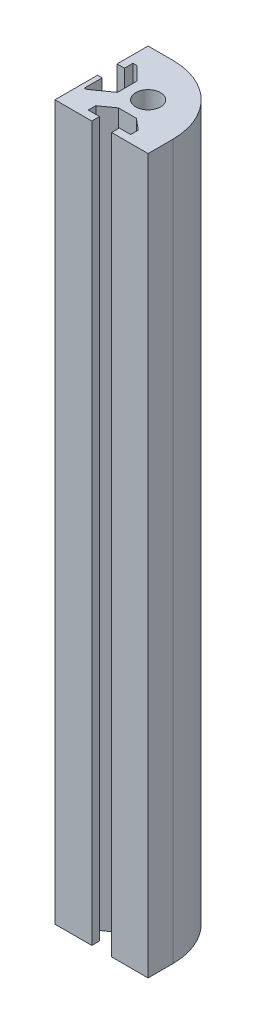
ISO-10303-21;
HEADER;
FILE_DESCRIPTION(('STEP AP214'),'2;1');
FILE_NAME('part.step','',(''),(''),'','','');
FILE_SCHEMA(('AUTOMOTIVE_DESIGN { 1 0 10303 214 1 1 1 1 }'));
ENDSEC;
DATA;
#1=APPLICATION_CONTEXT('core data for automotive mechanical design processes');
#2=APPLICATION_PROTOCOL_DEFINITION('international standard','automotive_design',2000,#1);
#3=PRODUCT_CONTEXT('',#1,'mechanical');
#4=PRODUCT('Part','Part','',(#3));
#5=PRODUCT_RELATED_PRODUCT_CATEGORY('part','',(#4));
#6=PRODUCT_DEFINITION_FORMATION('','',#4);
#7=PRODUCT_DEFINITION_CONTEXT('part definition',#1,'design');
#8=PRODUCT_DEFINITION('design','',#6,#7);
#9=PRODUCT_DEFINITION_SHAPE('','',#8);
#10=(LENGTH_UNIT() NAMED_UNIT(*) SI_UNIT(.MILLI.,.METRE.));
#11=(NAMED_UNIT(*) PLANE_ANGLE_UNIT() SI_UNIT($,.RADIAN.));
#12=(NAMED_UNIT(*) SI_UNIT($,.STERADIAN.) SOLID_ANGLE_UNIT());
#13=UNCERTAINTY_MEASURE_WITH_UNIT(LENGTH_MEASURE(1.E-05),#10,'distance_accuracy_value','');
#14=(GEOMETRIC_REPRESENTATION_CONTEXT(3) GLOBAL_UNCERTAINTY_ASSIGNED_CONTEXT((#13)) GLOBAL_UNIT_ASSIGNED_CONTEXT((#10,
#11,#12)) REPRESENTATION_CONTEXT('',''));
#15=CARTESIAN_POINT('',(0.,0.,0.));
#16=DIRECTION('',(0.,0.,1.));
#17=DIRECTION('',(1.,0.,0.));
#18=AXIS2_PLACEMENT_3D('',#15,#16,#17);
#19=CARTESIAN_POINT('',(-7.,230.,7.));
#20=DIRECTION('',(0.,-1.,0.));
#21=DIRECTION('',(0.,0.,-1.));
#22=AXIS2_PLACEMENT_3D('',#19,#20,#21);
#23=PLANE('',#22);
#24=DIRECTION('',(0.,0.,-1.));
#25=VECTOR('',#24,1.);
#26=CARTESIAN_POINT('',(15.,230.,15.));
#27=LINE('',#26,#25);
#28=CARTESIAN_POINT('',(15.,230.,15.));
#29=VERTEX_POINT('',#28);
#30=CARTESIAN_POINT('',(15.,230.,7.));
#31=VERTEX_POINT('',#30);
#32=EDGE_CURVE('E317',#29,#31,#27,.T.);
#33=ORIENTED_EDGE('',*,*,#32,.T.);
#34=CARTESIAN_POINT('',(-7.,230.,7.));
#35=DIRECTION('',(0.,1.,0.));
#36=DIRECTION('',(0.,0.,-1.));
#37=AXIS2_PLACEMENT_3D('',#34,#35,#36);
#38=CIRCLE('',#37,22.);
#39=CARTESIAN_POINT('',(-7.00000000000001,230.,-15.));
#40=VERTEX_POINT('',#39);
#41=EDGE_CURVE('E151',#31,#40,#38,.T.);
#42=ORIENTED_EDGE('',*,*,#41,.T.);
#43=DIRECTION('',(-1.,0.,0.));
#44=VECTOR('',#43,1.);
#45=CARTESIAN_POINT('',(-7.00000000000001,230.,-15.));
#46=LINE('',#45,#44);
#47=CARTESIAN_POINT('',(-15.,230.,-15.));
#48=VERTEX_POINT('',#47);
#49=EDGE_CURVE('E406',#40,#48,#46,.T.);
#50=ORIENTED_EDGE('',*,*,#49,.T.);
#51=DIRECTION('',(0.,0.,1.));
#52=VECTOR('',#51,1.);
#53=CARTESIAN_POINT('',(-15.,230.,-15.));
#54=LINE('',#53,#52);
#55=CARTESIAN_POINT('',(-15.,230.,-5.02760491674106));
#56=VERTEX_POINT('',#55);
#57=EDGE_CURVE('E426',#48,#56,#54,.T.);
#58=ORIENTED_EDGE('',*,*,#57,.T.);
#59=DIRECTION('',(1.,0.,0.));
#60=VECTOR('',#59,1.);
#61=CARTESIAN_POINT('',(-15.,230.,-5.02760491674106));
#62=LINE('',#61,#60);
#63=CARTESIAN_POINT('',(-12.62343706875,230.,-5.02760491674106));
#64=VERTEX_POINT('',#63);
#65=EDGE_CURVE('E422',#56,#64,#62,.T.);
#66=ORIENTED_EDGE('',*,*,#65,.T.);
#67=DIRECTION('',(0.,0.,-1.));
#68=VECTOR('',#67,1.);
#69=CARTESIAN_POINT('',(-12.62343706875,230.,-5.02760491674106));
#70=LINE('',#69,#68);
#71=CARTESIAN_POINT('',(-12.62343706875,230.,-7.75268234050665));
#72=VERTEX_POINT('',#71);
#73=EDGE_CURVE('E425',#64,#72,#70,.T.);
#74=ORIENTED_EDGE('',*,*,#73,.T.);
#75=DIRECTION('',(1.,0.,0.));
#76=VECTOR('',#75,1.);
#77=CARTESIAN_POINT('',(-12.62343706875,230.,-7.75268234050665));
#78=LINE('',#77,#76);
#79=CARTESIAN_POINT('',(-11.3205484379823,230.,-7.75268234050665));
#80=VERTEX_POINT('',#79);
#81=EDGE_CURVE('E430',#72,#80,#78,.T.);
#82=ORIENTED_EDGE('',*,*,#81,.T.);
#83=DIRECTION('',(0.707106781186548,0.,0.707106781186548));
#84=VECTOR('',#83,1.);
#85=CARTESIAN_POINT('',(-11.3205484379823,230.,-7.75268234050665));
#86=LINE('',#85,#84);
#87=CARTESIAN_POINT('',(-7.,230.,-3.43213390252437));
#88=VERTEX_POINT('',#87);
#89=EDGE_CURVE('E437',#80,#88,#86,.T.);
#90=ORIENTED_EDGE('',*,*,#89,.T.);
#91=DIRECTION('',(0.,0.,1.));
#92=VECTOR('',#91,1.);
#93=CARTESIAN_POINT('',(-7.,230.,-3.43213390252437));
#94=LINE('',#93,#92);
#95=CARTESIAN_POINT('',(-7.,230.,2.8610903108259));
#96=VERTEX_POINT('',#95);
#97=EDGE_CURVE('E440',#88,#96,#94,.T.);
#98=ORIENTED_EDGE('',*,*,#97,.T.);
#99=DIRECTION('',(-0.813663912579942,0.,0.581335563478702));
#100=VECTOR('',#99,1.);
#101=CARTESIAN_POINT('',(-7.,230.,2.8610903108259));
#102=LINE('',#101,#100);
#103=CARTESIAN_POINT('',(-12.793007796317,230.,7.00000000000001));
#104=VERTEX_POINT('',#103);
#105=EDGE_CURVE('E443',#96,#104,#102,.T.);
#106=ORIENTED_EDGE('',*,*,#105,.T.);
#107=DIRECTION('',(-1.,0.,0.));
#108=VECTOR('',#107,1.);
#109=CARTESIAN_POINT('',(-12.793007796317,230.,7.00000000000001));
#110=LINE('',#109,#108);
#111=CARTESIAN_POINT('',(-13.5272861174793,230.,7.00000000000001));
#112=VERTEX_POINT('',#111);
#113=EDGE_CURVE('E446',#104,#112,#110,.T.);
#114=ORIENTED_EDGE('',*,*,#113,.T.);
#115=DIRECTION('',(0.,0.,-1.));
#116=VECTOR('',#115,1.);
#117=CARTESIAN_POINT('',(-13.5272861174793,230.,7.00000000000001));
#118=LINE('',#117,#116);
#119=CARTESIAN_POINT('',(-13.5272861174793,230.,1.25796789040179));
#120=VERTEX_POINT('',#119);
#121=EDGE_CURVE('E449',#112,#120,#118,.T.);
#122=ORIENTED_EDGE('',*,*,#121,.T.);
#123=DIRECTION('',(-1.,0.,0.));
#124=VECTOR('',#123,1.);
#125=CARTESIAN_POINT('',(-13.5272861174793,230.,1.25796789040179));
#126=LINE('',#125,#124);
#127=CARTESIAN_POINT('',(-15.,230.,1.25796789040179));
#128=VERTEX_POINT('',#127);
#129=EDGE_CURVE('E452',#120,#128,#126,.T.);
#130=ORIENTED_EDGE('',*,*,#129,.T.);
#131=DIRECTION('',(0.,0.,1.));
#132=VECTOR('',#131,1.);
#133=CARTESIAN_POINT('',(-15.,230.,1.25796789040179));
#134=LINE('',#133,#132);
#135=CARTESIAN_POINT('',(-15.,230.,15.));
#136=VERTEX_POINT('',#135);
#137=EDGE_CURVE('E455',#128,#136,#134,.T.);
#138=ORIENTED_EDGE('',*,*,#137,.T.);
#139=DIRECTION('',(1.,0.,0.));
#140=VECTOR('',#139,1.);
#141=CARTESIAN_POINT('',(-15.,230.,15.));
#142=LINE('',#141,#140);
#143=CARTESIAN_POINT('',(-3.13994125446428,230.,15.));
#144=VERTEX_POINT('',#143);
#145=EDGE_CURVE('E458',#136,#144,#142,.T.);
#146=ORIENTED_EDGE('',*,*,#145,.T.);
#147=DIRECTION('',(0.,0.,-1.));
#148=VECTOR('',#147,1.);
#149=CARTESIAN_POINT('',(-3.13994125446428,230.,15.));
#150=LINE('',#149,#148);
#151=CARTESIAN_POINT('',(-3.13994125446428,230.,12.5058350189732));
#152=VERTEX_POINT('',#151);
#153=EDGE_CURVE('E461',#144,#152,#150,.T.);
#154=ORIENTED_EDGE('',*,*,#153,.T.);
#155=DIRECTION('',(-1.,0.,0.));
#156=VECTOR('',#155,1.);
#157=CARTESIAN_POINT('',(-3.13994125446428,230.,12.5058350189732));
#158=LINE('',#157,#156);
#159=CARTESIAN_POINT('',(-6.77895709017856,230.,12.5058350189732));
#160=VERTEX_POINT('',#159);
#161=EDGE_CURVE('E464',#152,#160,#158,.T.);
#162=ORIENTED_EDGE('',*,*,#161,.T.);
#163=DIRECTION('',(0.,0.,-1.));
#164=VECTOR('',#163,1.);
#165=CARTESIAN_POINT('',(-6.77895709017856,230.,12.5058350189732));
#166=LINE('',#165,#164);
#167=CARTESIAN_POINT('',(-6.77895709017856,230.,10.0798244618304));
#168=VERTEX_POINT('',#167);
#169=EDGE_CURVE('E467',#160,#168,#166,.T.);
#170=ORIENTED_EDGE('',*,*,#169,.T.);
#171=DIRECTION('',(0.813663912579942,0.,-0.581335563478702));
#172=VECTOR('',#171,1.);
#173=CARTESIAN_POINT('',(-6.77895709017856,230.,10.0798244618304));
#174=LINE('',#173,#172);
#175=CARTESIAN_POINT('',(-2.51290963769489,230.,7.03187670198325));
#176=VERTEX_POINT('',#175);
#177=EDGE_CURVE('E470',#168,#176,#174,.T.);
#178=ORIENTED_EDGE('',*,*,#177,.T.);
#179=DIRECTION('',(1.,0.,0.));
#180=VECTOR('',#179,1.);
#181=CARTESIAN_POINT('',(-2.51290963769489,230.,7.03187670198325));
#182=LINE('',#181,#180);
#183=CARTESIAN_POINT('',(3.25590475982143,230.,7.03187670198325));
#184=VERTEX_POINT('',#183);
#185=EDGE_CURVE('E473',#176,#184,#182,.T.);
#186=ORIENTED_EDGE('',*,*,#185,.T.);
#187=DIRECTION('',(0.766619760050027,0.,0.642101349866857));
#188=VECTOR('',#187,1.);
#189=CARTESIAN_POINT('',(3.25590475982143,230.,7.03187670198325));
#190=LINE('',#189,#188);
#191=CARTESIAN_POINT('',(6.89492059553572,230.,10.0798244618304));
#192=VERTEX_POINT('',#191);
#193=EDGE_CURVE('E476',#184,#192,#190,.T.);
#194=ORIENTED_EDGE('',*,*,#193,.T.);
#195=DIRECTION('',(0.,0.,1.));
#196=VECTOR('',#195,1.);
#197=CARTESIAN_POINT('',(6.89492059553572,230.,10.0798244618304));
#198=LINE('',#197,#196);
#199=CARTESIAN_POINT('',(6.89492059553572,230.,12.5058350189732));
#200=VERTEX_POINT('',#199);
#201=EDGE_CURVE('E221',#192,#200,#198,.T.);
#202=ORIENTED_EDGE('',*,*,#201,.T.);
#203=DIRECTION('',(-1.,0.,0.));
#204=VECTOR('',#203,1.);
#205=CARTESIAN_POINT('',(6.89492059553572,230.,12.5058350189732));
#206=LINE('',#205,#204);
#207=CARTESIAN_POINT('',(3.25590475982143,230.,12.5058350189732));
#208=VERTEX_POINT('',#207);
#209=EDGE_CURVE('E215',#200,#208,#206,.T.);
#210=ORIENTED_EDGE('',*,*,#209,.T.);
#211=DIRECTION('',(0.,0.,1.));
#212=VECTOR('',#211,1.);
#213=CARTESIAN_POINT('',(3.25590475982143,230.,12.5058350189732));
#214=LINE('',#213,#212);
#215=CARTESIAN_POINT('',(3.25590475982143,230.,15.));
#216=VERTEX_POINT('',#215);
#217=EDGE_CURVE('E219',#208,#216,#214,.T.);
#218=ORIENTED_EDGE('',*,*,#217,.T.);
#219=DIRECTION('',(1.,0.,0.));
#220=VECTOR('',#219,1.);
#221=CARTESIAN_POINT('',(3.25590475982143,230.,15.));
#222=LINE('',#221,#220);
#223=EDGE_CURVE('E57',#216,#29,#222,.T.);
#224=ORIENTED_EDGE('',*,*,#223,.T.);
#225=EDGE_LOOP('',(#33,#42,#50,#58,#66,#74,#82,#90,#98,#106,#114,#122,#130,#138,#146,#154,#162,
#170,#178,#186,#194,#202,#210,#218,#224));
#226=FACE_BOUND('',#225,.T.);
#227=CARTESIAN_POINT('',(0.,230.,0.));
#228=DIRECTION('',(0.,1.,0.));
#229=DIRECTION('',(0.,0.,1.));
#230=AXIS2_PLACEMENT_3D('',#227,#228,#229);
#231=CIRCLE('',#230,4.);
#232=CARTESIAN_POINT('',(0.,230.,4.));
#233=VERTEX_POINT('',#232);
#234=EDGE_CURVE('E248',#233,#233,#231,.T.);
#235=ORIENTED_EDGE('',*,*,#234,.F.);
#236=EDGE_LOOP('',(#235));
#237=FACE_BOUND('',#236,.T.);
#238=ADVANCED_FACE('F39',(#226,#237),#23,.F.);
#239=CARTESIAN_POINT('',(-7.,0.,7.));
#240=DIRECTION('',(0.,-1.,0.));
#241=DIRECTION('',(0.,0.,-1.));
#242=AXIS2_PLACEMENT_3D('',#239,#240,#241);
#243=PLANE('',#242);
#244=DIRECTION('',(0.,0.,-1.));
#245=VECTOR('',#244,1.);
#246=CARTESIAN_POINT('',(15.,0.,15.));
#247=LINE('',#246,#245);
#248=CARTESIAN_POINT('',(15.,0.,15.));
#249=VERTEX_POINT('',#248);
#250=CARTESIAN_POINT('',(15.,0.,7.));
#251=VERTEX_POINT('',#250);
#252=EDGE_CURVE('E243',#249,#251,#247,.T.);
#253=ORIENTED_EDGE('',*,*,#252,.F.);
#254=DIRECTION('',(1.,0.,0.));
#255=VECTOR('',#254,1.);
#256=CARTESIAN_POINT('',(3.25590475982143,0.,15.));
#257=LINE('',#256,#255);
#258=CARTESIAN_POINT('',(3.25590475982143,0.,15.));
#259=VERTEX_POINT('',#258);
#260=EDGE_CURVE('E143',#259,#249,#257,.T.);
#261=ORIENTED_EDGE('',*,*,#260,.F.);
#262=DIRECTION('',(0.,0.,1.));
#263=VECTOR('',#262,1.);
#264=CARTESIAN_POINT('',(3.25590475982143,0.,12.5058350189732));
#265=LINE('',#264,#263);
#266=CARTESIAN_POINT('',(3.25590475982143,0.,12.5058350189732));
#267=VERTEX_POINT('',#266);
#268=EDGE_CURVE('E137',#267,#259,#265,.T.);
#269=ORIENTED_EDGE('',*,*,#268,.F.);
#270=DIRECTION('',(-1.,0.,0.));
#271=VECTOR('',#270,1.);
#272=CARTESIAN_POINT('',(6.89492059553572,0.,12.5058350189732));
#273=LINE('',#272,#271);
#274=CARTESIAN_POINT('',(6.89492059553572,0.,12.5058350189732));
#275=VERTEX_POINT('',#274);
#276=EDGE_CURVE('E230',#275,#267,#273,.T.);
#277=ORIENTED_EDGE('',*,*,#276,.F.);
#278=DIRECTION('',(0.,0.,1.));
#279=VECTOR('',#278,1.);
#280=CARTESIAN_POINT('',(6.89492059553572,0.,10.0798244618304));
#281=LINE('',#280,#279);
#282=CARTESIAN_POINT('',(6.89492059553572,0.,10.0798244618304));
#283=VERTEX_POINT('',#282);
#284=EDGE_CURVE('E308',#283,#275,#281,.T.);
#285=ORIENTED_EDGE('',*,*,#284,.F.);
#286=DIRECTION('',(0.766619760050027,0.,0.642101349866857));
#287=VECTOR('',#286,1.);
#288=CARTESIAN_POINT('',(3.25590475982143,0.,7.03187670198325));
#289=LINE('',#288,#287);
#290=CARTESIAN_POINT('',(3.25590475982143,0.,7.03187670198325));
#291=VERTEX_POINT('',#290);
#292=EDGE_CURVE('E305',#291,#283,#289,.T.);
#293=ORIENTED_EDGE('',*,*,#292,.F.);
#294=DIRECTION('',(1.,0.,0.));
#295=VECTOR('',#294,1.);
#296=CARTESIAN_POINT('',(-2.51290963769489,0.,7.03187670198325));
#297=LINE('',#296,#295);
#298=CARTESIAN_POINT('',(-2.51290963769489,0.,7.03187670198325));
#299=VERTEX_POINT('',#298);
#300=EDGE_CURVE('E302',#299,#291,#297,.T.);
#301=ORIENTED_EDGE('',*,*,#300,.F.);
#302=DIRECTION('',(0.813663912579942,0.,-0.581335563478702));
#303=VECTOR('',#302,1.);
#304=CARTESIAN_POINT('',(-6.77895709017856,0.,10.0798244618304));
#305=LINE('',#304,#303);
#306=CARTESIAN_POINT('',(-6.77895709017856,0.,10.0798244618304));
#307=VERTEX_POINT('',#306);
#308=EDGE_CURVE('E299',#307,#299,#305,.T.);
#309=ORIENTED_EDGE('',*,*,#308,.F.);
#310=DIRECTION('',(0.,0.,-1.));
#311=VECTOR('',#310,1.);
#312=CARTESIAN_POINT('',(-6.77895709017856,0.,12.5058350189732));
#313=LINE('',#312,#311);
#314=CARTESIAN_POINT('',(-6.77895709017856,0.,12.5058350189732));
#315=VERTEX_POINT('',#314);
#316=EDGE_CURVE('E296',#315,#307,#313,.T.);
#317=ORIENTED_EDGE('',*,*,#316,.F.);
#318=DIRECTION('',(-1.,0.,0.));
#319=VECTOR('',#318,1.);
#320=CARTESIAN_POINT('',(-3.13994125446428,0.,12.5058350189732));
#321=LINE('',#320,#319);
#322=CARTESIAN_POINT('',(-3.13994125446428,0.,12.5058350189732));
#323=VERTEX_POINT('',#322);
#324=EDGE_CURVE('E293',#323,#315,#321,.T.);
#325=ORIENTED_EDGE('',*,*,#324,.F.);
#326=DIRECTION('',(0.,0.,-1.));
#327=VECTOR('',#326,1.);
#328=CARTESIAN_POINT('',(-3.13994125446428,0.,15.));
#329=LINE('',#328,#327);
#330=CARTESIAN_POINT('',(-3.13994125446428,0.,15.));
#331=VERTEX_POINT('',#330);
#332=EDGE_CURVE('E290',#331,#323,#329,.T.);
#333=ORIENTED_EDGE('',*,*,#332,.F.);
#334=DIRECTION('',(1.,0.,0.));
#335=VECTOR('',#334,1.);
#336=CARTESIAN_POINT('',(-15.,0.,15.));
#337=LINE('',#336,#335);
#338=CARTESIAN_POINT('',(-15.,0.,15.));
#339=VERTEX_POINT('',#338);
#340=EDGE_CURVE('E287',#339,#331,#337,.T.);
#341=ORIENTED_EDGE('',*,*,#340,.F.);
#342=DIRECTION('',(0.,0.,1.));
#343=VECTOR('',#342,1.);
#344=CARTESIAN_POINT('',(-15.,0.,1.25796789040179));
#345=LINE('',#344,#343);
#346=CARTESIAN_POINT('',(-15.,0.,1.25796789040179));
#347=VERTEX_POINT('',#346);
#348=EDGE_CURVE('E284',#347,#339,#345,.T.);
#349=ORIENTED_EDGE('',*,*,#348,.F.);
#350=DIRECTION('',(-1.,0.,0.));
#351=VECTOR('',#350,1.);
#352=CARTESIAN_POINT('',(-13.5272861174793,0.,1.25796789040179));
#353=LINE('',#352,#351);
#354=CARTESIAN_POINT('',(-13.5272861174793,0.,1.25796789040179));
#355=VERTEX_POINT('',#354);
#356=EDGE_CURVE('E281',#355,#347,#353,.T.);
#357=ORIENTED_EDGE('',*,*,#356,.F.);
#358=DIRECTION('',(0.,0.,-1.));
#359=VECTOR('',#358,1.);
#360=CARTESIAN_POINT('',(-13.5272861174793,0.,7.00000000000001));
#361=LINE('',#360,#359);
#362=CARTESIAN_POINT('',(-13.5272861174793,0.,7.00000000000001));
#363=VERTEX_POINT('',#362);
#364=EDGE_CURVE('E278',#363,#355,#361,.T.);
#365=ORIENTED_EDGE('',*,*,#364,.F.);
#366=DIRECTION('',(-1.,0.,0.));
#367=VECTOR('',#366,1.);
#368=CARTESIAN_POINT('',(-12.793007796317,0.,7.00000000000001));
#369=LINE('',#368,#367);
#370=CARTESIAN_POINT('',(-12.793007796317,0.,7.00000000000001));
#371=VERTEX_POINT('',#370);
#372=EDGE_CURVE('E275',#371,#363,#369,.T.);
#373=ORIENTED_EDGE('',*,*,#372,.F.);
#374=DIRECTION('',(-0.813663912579942,0.,0.581335563478702));
#375=VECTOR('',#374,1.);
#376=CARTESIAN_POINT('',(-7.,0.,2.8610903108259));
#377=LINE('',#376,#375);
#378=CARTESIAN_POINT('',(-7.,0.,2.8610903108259));
#379=VERTEX_POINT('',#378);
#380=EDGE_CURVE('E272',#379,#371,#377,.T.);
#381=ORIENTED_EDGE('',*,*,#380,.F.);
#382=DIRECTION('',(0.,0.,1.));
#383=VECTOR('',#382,1.);
#384=CARTESIAN_POINT('',(-7.,0.,-3.43213390252437));
#385=LINE('',#384,#383);
#386=CARTESIAN_POINT('',(-7.,0.,-3.43213390252437));
#387=VERTEX_POINT('',#386);
#388=EDGE_CURVE('E269',#387,#379,#385,.T.);
#389=ORIENTED_EDGE('',*,*,#388,.F.);
#390=DIRECTION('',(0.707106781186548,0.,0.707106781186548));
#391=VECTOR('',#390,1.);
#392=CARTESIAN_POINT('',(-11.3205484379823,0.,-7.75268234050665));
#393=LINE('',#392,#391);
#394=CARTESIAN_POINT('',(-11.3205484379823,0.,-7.75268234050665));
#395=VERTEX_POINT('',#394);
#396=EDGE_CURVE('E266',#395,#387,#393,.T.);
#397=ORIENTED_EDGE('',*,*,#396,.F.);
#398=DIRECTION('',(1.,0.,0.));
#399=VECTOR('',#398,1.);
#400=CARTESIAN_POINT('',(-12.62343706875,0.,-7.75268234050665));
#401=LINE('',#400,#399);
#402=CARTESIAN_POINT('',(-12.62343706875,0.,-7.75268234050665));
#403=VERTEX_POINT('',#402);
#404=EDGE_CURVE('E263',#403,#395,#401,.T.);
#405=ORIENTED_EDGE('',*,*,#404,.F.);
#406=DIRECTION('',(0.,0.,-1.));
#407=VECTOR('',#406,1.);
#408=CARTESIAN_POINT('',(-12.62343706875,0.,-5.02760491674106));
#409=LINE('',#408,#407);
#410=CARTESIAN_POINT('',(-12.62343706875,0.,-5.02760491674106));
#411=VERTEX_POINT('',#410);
#412=EDGE_CURVE('E260',#411,#403,#409,.T.);
#413=ORIENTED_EDGE('',*,*,#412,.F.);
#414=DIRECTION('',(1.,0.,0.));
#415=VECTOR('',#414,1.);
#416=CARTESIAN_POINT('',(-15.,0.,-5.02760491674106));
#417=LINE('',#416,#415);
#418=CARTESIAN_POINT('',(-15.,0.,-5.02760491674106));
#419=VERTEX_POINT('',#418);
#420=EDGE_CURVE('E257',#419,#411,#417,.T.);
#421=ORIENTED_EDGE('',*,*,#420,.F.);
#422=DIRECTION('',(0.,0.,1.));
#423=VECTOR('',#422,1.);
#424=CARTESIAN_POINT('',(-15.,0.,-15.));
#425=LINE('',#424,#423);
#426=CARTESIAN_POINT('',(-15.,0.,-15.));
#427=VERTEX_POINT('',#426);
#428=EDGE_CURVE('E254',#427,#419,#425,.T.);
#429=ORIENTED_EDGE('',*,*,#428,.F.);
#430=DIRECTION('',(-1.,0.,0.));
#431=VECTOR('',#430,1.);
#432=CARTESIAN_POINT('',(-7.00000000000001,0.,-15.));
#433=LINE('',#432,#431);
#434=CARTESIAN_POINT('',(-7.00000000000001,0.,-15.));
#435=VERTEX_POINT('',#434);
#436=EDGE_CURVE('E251',#435,#427,#433,.T.);
#437=ORIENTED_EDGE('',*,*,#436,.F.);
#438=CARTESIAN_POINT('',(-7.,0.,7.));
#439=DIRECTION('',(0.,1.,0.));
#440=DIRECTION('',(0.,0.,-1.));
#441=AXIS2_PLACEMENT_3D('',#438,#439,#440);
#442=CIRCLE('',#441,22.);
#443=EDGE_CURVE('E247',#251,#435,#442,.T.);
#444=ORIENTED_EDGE('',*,*,#443,.F.);
#445=EDGE_LOOP('',(#253,#261,#269,#277,#285,#293,#301,#309,#317,#325,#333,#341,#349,#357,#365,
#373,#381,#389,#397,#405,#413,#421,#429,#437,#444));
#446=FACE_BOUND('',#445,.T.);
#447=CARTESIAN_POINT('',(0.,0.,0.));
#448=DIRECTION('',(0.,1.,0.));
#449=DIRECTION('',(0.,0.,1.));
#450=AXIS2_PLACEMENT_3D('',#447,#448,#449);
#451=CIRCLE('',#450,4.);
#452=CARTESIAN_POINT('',(0.,0.,4.));
#453=VERTEX_POINT('',#452);
#454=EDGE_CURVE('E794',#453,#453,#451,.T.);
#455=ORIENTED_EDGE('',*,*,#454,.T.);
#456=EDGE_LOOP('',(#455));
#457=FACE_BOUND('',#456,.T.);
#458=ADVANCED_FACE('F410',(#446,#457),#243,.T.);
#459=CARTESIAN_POINT('',(15.,230.,15.));
#460=DIRECTION('',(-1.,0.,0.));
#461=DIRECTION('',(0.,0.,1.));
#462=AXIS2_PLACEMENT_3D('',#459,#460,#461);
#463=PLANE('',#462);
#464=ORIENTED_EDGE('',*,*,#252,.T.);
#465=DIRECTION('',(0.,-1.,0.));
#466=VECTOR('',#465,1.);
#467=CARTESIAN_POINT('',(15.,230.,7.));
#468=LINE('',#467,#466);
#469=EDGE_CURVE('E11',#31,#251,#468,.T.);
#470=ORIENTED_EDGE('',*,*,#469,.F.);
#471=ORIENTED_EDGE('',*,*,#32,.F.);
#472=DIRECTION('',(0.,-1.,0.));
#473=VECTOR('',#472,1.);
#474=CARTESIAN_POINT('',(15.,230.,15.));
#475=LINE('',#474,#473);
#476=EDGE_CURVE('E239',#29,#249,#475,.T.);
#477=ORIENTED_EDGE('',*,*,#476,.T.);
#478=EDGE_LOOP('',(#464,#470,#471,#477));
#479=FACE_BOUND('',#478,.T.);
#480=ADVANCED_FACE('F41',(#479),#463,.F.);
#481=CARTESIAN_POINT('',(-7.,230.,7.));
#482=DIRECTION('',(0.,-1.,0.));
#483=DIRECTION('',(0.,0.,-1.));
#484=AXIS2_PLACEMENT_3D('',#481,#482,#483);
#485=CYLINDRICAL_SURFACE('',#484,22.);
#486=ORIENTED_EDGE('',*,*,#443,.T.);
#487=DIRECTION('',(0.,-1.,0.));
#488=VECTOR('',#487,1.);
#489=CARTESIAN_POINT('',(-7.00000000000001,230.,-15.));
#490=LINE('',#489,#488);
#491=EDGE_CURVE('E49',#40,#435,#490,.T.);
#492=ORIENTED_EDGE('',*,*,#491,.F.);
#493=ORIENTED_EDGE('',*,*,#41,.F.);
#494=ORIENTED_EDGE('',*,*,#469,.T.);
#495=EDGE_LOOP('',(#486,#492,#493,#494));
#496=FACE_BOUND('',#495,.T.);
#497=ADVANCED_FACE('F512',(#496),#485,.T.);
#498=CARTESIAN_POINT('',(-7.00000000000001,230.,-15.));
#499=DIRECTION('',(0.,0.,1.));
#500=DIRECTION('',(1.,0.,0.));
#501=AXIS2_PLACEMENT_3D('',#498,#499,#500);
#502=PLANE('',#501);
#503=ORIENTED_EDGE('',*,*,#436,.T.);
#504=DIRECTION('',(0.,-1.,0.));
#505=VECTOR('',#504,1.);
#506=CARTESIAN_POINT('',(-15.,230.,-15.));
#507=LINE('',#506,#505);
#508=EDGE_CURVE('E396',#48,#427,#507,.T.);
#509=ORIENTED_EDGE('',*,*,#508,.F.);
#510=ORIENTED_EDGE('',*,*,#49,.F.);
#511=ORIENTED_EDGE('',*,*,#491,.T.);
#512=EDGE_LOOP('',(#503,#509,#510,#511));
#513=FACE_BOUND('',#512,.T.);
#514=ADVANCED_FACE('F404',(#513),#502,.F.);
#515=CARTESIAN_POINT('',(-15.,230.,-15.));
#516=DIRECTION('',(1.,0.,0.));
#517=DIRECTION('',(0.,0.,-1.));
#518=AXIS2_PLACEMENT_3D('',#515,#516,#517);
#519=PLANE('',#518);
#520=ORIENTED_EDGE('',*,*,#428,.T.);
#521=DIRECTION('',(0.,-1.,0.));
#522=VECTOR('',#521,1.);
#523=CARTESIAN_POINT('',(-15.,230.,-5.02760491674106));
#524=LINE('',#523,#522);
#525=EDGE_CURVE('E392',#56,#419,#524,.T.);
#526=ORIENTED_EDGE('',*,*,#525,.F.);
#527=ORIENTED_EDGE('',*,*,#57,.F.);
#528=ORIENTED_EDGE('',*,*,#508,.T.);
#529=EDGE_LOOP('',(#520,#526,#527,#528));
#530=FACE_BOUND('',#529,.T.);
#531=ADVANCED_FACE('F416',(#530),#519,.F.);
#532=CARTESIAN_POINT('',(-15.,230.,-5.02760491674106));
#533=DIRECTION('',(0.,0.,-1.));
#534=DIRECTION('',(-1.,0.,0.));
#535=AXIS2_PLACEMENT_3D('',#532,#533,#534);
#536=PLANE('',#535);
#537=ORIENTED_EDGE('',*,*,#420,.T.);
#538=DIRECTION('',(0.,-1.,0.));
#539=VECTOR('',#538,1.);
#540=CARTESIAN_POINT('',(-12.62343706875,230.,-5.02760491674106));
#541=LINE('',#540,#539);
#542=EDGE_CURVE('E388',#64,#411,#541,.T.);
#543=ORIENTED_EDGE('',*,*,#542,.F.);
#544=ORIENTED_EDGE('',*,*,#65,.F.);
#545=ORIENTED_EDGE('',*,*,#525,.T.);
#546=EDGE_LOOP('',(#537,#543,#544,#545));
#547=FACE_BOUND('',#546,.T.);
#548=ADVANCED_FACE('F420',(#547),#536,.F.);
#549=CARTESIAN_POINT('',(-12.62343706875,230.,-5.02760491674106));
#550=DIRECTION('',(-1.,0.,0.));
#551=DIRECTION('',(0.,0.,1.));
#552=AXIS2_PLACEMENT_3D('',#549,#550,#551);
#553=PLANE('',#552);
#554=ORIENTED_EDGE('',*,*,#412,.T.);
#555=DIRECTION('',(0.,-1.,0.));
#556=VECTOR('',#555,1.);
#557=CARTESIAN_POINT('',(-12.62343706875,230.,-7.75268234050665));
#558=LINE('',#557,#556);
#559=EDGE_CURVE('E384',#72,#403,#558,.T.);
#560=ORIENTED_EDGE('',*,*,#559,.F.);
#561=ORIENTED_EDGE('',*,*,#73,.F.);
#562=ORIENTED_EDGE('',*,*,#542,.T.);
#563=EDGE_LOOP('',(#554,#560,#561,#562));
#564=FACE_BOUND('',#563,.T.);
#565=ADVANCED_FACE('F525',(#564),#553,.F.);
#566=CARTESIAN_POINT('',(-12.62343706875,230.,-7.75268234050665));
#567=DIRECTION('',(0.,0.,-1.));
#568=DIRECTION('',(-1.,0.,0.));
#569=AXIS2_PLACEMENT_3D('',#566,#567,#568);
#570=PLANE('',#569);
#571=ORIENTED_EDGE('',*,*,#404,.T.);
#572=DIRECTION('',(0.,-1.,0.));
#573=VECTOR('',#572,1.);
#574=CARTESIAN_POINT('',(-11.3205484379823,230.,-7.75268234050665));
#575=LINE('',#574,#573);
#576=EDGE_CURVE('E380',#80,#395,#575,.T.);
#577=ORIENTED_EDGE('',*,*,#576,.F.);
#578=ORIENTED_EDGE('',*,*,#81,.F.);
#579=ORIENTED_EDGE('',*,*,#559,.T.);
#580=EDGE_LOOP('',(#571,#577,#578,#579));
#581=FACE_BOUND('',#580,.T.);
#582=ADVANCED_FACE('F528',(#581),#570,.F.);
#583=CARTESIAN_POINT('',(-11.3205484379823,230.,-7.75268234050665));
#584=DIRECTION('',(0.707106781186547,0.,-0.707106781186547));
#585=DIRECTION('',(-0.707106781186548,0.,-0.707106781186548));
#586=AXIS2_PLACEMENT_3D('',#583,#584,#585);
#587=PLANE('',#586);
#588=ORIENTED_EDGE('',*,*,#396,.T.);
#589=DIRECTION('',(0.,-1.,0.));
#590=VECTOR('',#589,1.);
#591=CARTESIAN_POINT('',(-7.,230.,-3.43213390252437));
#592=LINE('',#591,#590);
#593=EDGE_CURVE('E376',#88,#387,#592,.T.);
#594=ORIENTED_EDGE('',*,*,#593,.F.);
#595=ORIENTED_EDGE('',*,*,#89,.F.);
#596=ORIENTED_EDGE('',*,*,#576,.T.);
#597=EDGE_LOOP('',(#588,#594,#595,#596));
#598=FACE_BOUND('',#597,.T.);
#599=ADVANCED_FACE('F532',(#598),#587,.F.);
#600=CARTESIAN_POINT('',(-7.,230.,-3.43213390252437));
#601=DIRECTION('',(1.,0.,0.));
#602=DIRECTION('',(0.,0.,-1.));
#603=AXIS2_PLACEMENT_3D('',#600,#601,#602);
#604=PLANE('',#603);
#605=ORIENTED_EDGE('',*,*,#388,.T.);
#606=DIRECTION('',(0.,-1.,0.));
#607=VECTOR('',#606,1.);
#608=CARTESIAN_POINT('',(-7.,230.,2.8610903108259));
#609=LINE('',#608,#607);
#610=EDGE_CURVE('E372',#96,#379,#609,.T.);
#611=ORIENTED_EDGE('',*,*,#610,.F.);
#612=ORIENTED_EDGE('',*,*,#97,.F.);
#613=ORIENTED_EDGE('',*,*,#593,.T.);
#614=EDGE_LOOP('',(#605,#611,#612,#613));
#615=FACE_BOUND('',#614,.T.);
#616=ADVANCED_FACE('F536',(#615),#604,.F.);
#617=CARTESIAN_POINT('',(-7.,230.,2.8610903108259));
#618=DIRECTION('',(0.581335563478702,0.,0.813663912579942));
#619=DIRECTION('',(0.813663912579942,0.,-0.581335563478702));
#620=AXIS2_PLACEMENT_3D('',#617,#618,#619);
#621=PLANE('',#620);
#622=ORIENTED_EDGE('',*,*,#380,.T.);
#623=DIRECTION('',(0.,-1.,0.));
#624=VECTOR('',#623,1.);
#625=CARTESIAN_POINT('',(-12.793007796317,230.,7.00000000000001));
#626=LINE('',#625,#624);
#627=EDGE_CURVE('E368',#104,#371,#626,.T.);
#628=ORIENTED_EDGE('',*,*,#627,.F.);
#629=ORIENTED_EDGE('',*,*,#105,.F.);
#630=ORIENTED_EDGE('',*,*,#610,.T.);
#631=EDGE_LOOP('',(#622,#628,#629,#630));
#632=FACE_BOUND('',#631,.T.);
#633=ADVANCED_FACE('F540',(#632),#621,.F.);
#634=CARTESIAN_POINT('',(-12.793007796317,230.,7.00000000000001));
#635=DIRECTION('',(0.,0.,1.));
#636=DIRECTION('',(1.,0.,0.));
#637=AXIS2_PLACEMENT_3D('',#634,#635,#636);
#638=PLANE('',#637);
#639=ORIENTED_EDGE('',*,*,#372,.T.);
#640=DIRECTION('',(0.,-1.,0.));
#641=VECTOR('',#640,1.);
#642=CARTESIAN_POINT('',(-13.5272861174793,230.,7.00000000000001));
#643=LINE('',#642,#641);
#644=EDGE_CURVE('E364',#112,#363,#643,.T.);
#645=ORIENTED_EDGE('',*,*,#644,.F.);
#646=ORIENTED_EDGE('',*,*,#113,.F.);
#647=ORIENTED_EDGE('',*,*,#627,.T.);
#648=EDGE_LOOP('',(#639,#645,#646,#647));
#649=FACE_BOUND('',#648,.T.);
#650=ADVANCED_FACE('F544',(#649),#638,.F.);
#651=CARTESIAN_POINT('',(-13.5272861174793,230.,7.00000000000001));
#652=DIRECTION('',(-1.,0.,0.));
#653=DIRECTION('',(0.,0.,1.));
#654=AXIS2_PLACEMENT_3D('',#651,#652,#653);
#655=PLANE('',#654);
#656=ORIENTED_EDGE('',*,*,#364,.T.);
#657=DIRECTION('',(0.,-1.,0.));
#658=VECTOR('',#657,1.);
#659=CARTESIAN_POINT('',(-13.5272861174793,230.,1.25796789040179));
#660=LINE('',#659,#658);
#661=EDGE_CURVE('E360',#120,#355,#660,.T.);
#662=ORIENTED_EDGE('',*,*,#661,.F.);
#663=ORIENTED_EDGE('',*,*,#121,.F.);
#664=ORIENTED_EDGE('',*,*,#644,.T.);
#665=EDGE_LOOP('',(#656,#662,#663,#664));
#666=FACE_BOUND('',#665,.T.);
#667=ADVANCED_FACE('F548',(#666),#655,.F.);
#668=CARTESIAN_POINT('',(-13.5272861174793,230.,1.25796789040179));
#669=DIRECTION('',(0.,0.,1.));
#670=DIRECTION('',(1.,0.,0.));
#671=AXIS2_PLACEMENT_3D('',#668,#669,#670);
#672=PLANE('',#671);
#673=ORIENTED_EDGE('',*,*,#356,.T.);
#674=DIRECTION('',(0.,-1.,0.));
#675=VECTOR('',#674,1.);
#676=CARTESIAN_POINT('',(-15.,230.,1.25796789040179));
#677=LINE('',#676,#675);
#678=EDGE_CURVE('E356',#128,#347,#677,.T.);
#679=ORIENTED_EDGE('',*,*,#678,.F.);
#680=ORIENTED_EDGE('',*,*,#129,.F.);
#681=ORIENTED_EDGE('',*,*,#661,.T.);
#682=EDGE_LOOP('',(#673,#679,#680,#681));
#683=FACE_BOUND('',#682,.T.);
#684=ADVANCED_FACE('F552',(#683),#672,.F.);
#685=CARTESIAN_POINT('',(-15.,230.,1.25796789040179));
#686=DIRECTION('',(1.,0.,0.));
#687=DIRECTION('',(0.,0.,-1.));
#688=AXIS2_PLACEMENT_3D('',#685,#686,#687);
#689=PLANE('',#688);
#690=ORIENTED_EDGE('',*,*,#348,.T.);
#691=DIRECTION('',(0.,-1.,0.));
#692=VECTOR('',#691,1.);
#693=CARTESIAN_POINT('',(-15.,230.,15.));
#694=LINE('',#693,#692);
#695=EDGE_CURVE('E352',#136,#339,#694,.T.);
#696=ORIENTED_EDGE('',*,*,#695,.F.);
#697=ORIENTED_EDGE('',*,*,#137,.F.);
#698=ORIENTED_EDGE('',*,*,#678,.T.);
#699=EDGE_LOOP('',(#690,#696,#697,#698));
#700=FACE_BOUND('',#699,.T.);
#701=ADVANCED_FACE('F556',(#700),#689,.F.);
#702=CARTESIAN_POINT('',(-15.,230.,15.));
#703=DIRECTION('',(0.,0.,-1.));
#704=DIRECTION('',(-1.,0.,0.));
#705=AXIS2_PLACEMENT_3D('',#702,#703,#704);
#706=PLANE('',#705);
#707=ORIENTED_EDGE('',*,*,#340,.T.);
#708=DIRECTION('',(0.,-1.,0.));
#709=VECTOR('',#708,1.);
#710=CARTESIAN_POINT('',(-3.13994125446428,230.,15.));
#711=LINE('',#710,#709);
#712=EDGE_CURVE('E348',#144,#331,#711,.T.);
#713=ORIENTED_EDGE('',*,*,#712,.F.);
#714=ORIENTED_EDGE('',*,*,#145,.F.);
#715=ORIENTED_EDGE('',*,*,#695,.T.);
#716=EDGE_LOOP('',(#707,#713,#714,#715));
#717=FACE_BOUND('',#716,.T.);
#718=ADVANCED_FACE('F560',(#717),#706,.F.);
#719=CARTESIAN_POINT('',(-3.13994125446428,230.,15.));
#720=DIRECTION('',(-1.,0.,0.));
#721=DIRECTION('',(0.,0.,1.));
#722=AXIS2_PLACEMENT_3D('',#719,#720,#721);
#723=PLANE('',#722);
#724=ORIENTED_EDGE('',*,*,#332,.T.);
#725=DIRECTION('',(0.,-1.,0.));
#726=VECTOR('',#725,1.);
#727=CARTESIAN_POINT('',(-3.13994125446428,230.,12.5058350189732));
#728=LINE('',#727,#726);
#729=EDGE_CURVE('E344',#152,#323,#728,.T.);
#730=ORIENTED_EDGE('',*,*,#729,.F.);
#731=ORIENTED_EDGE('',*,*,#153,.F.);
#732=ORIENTED_EDGE('',*,*,#712,.T.);
#733=EDGE_LOOP('',(#724,#730,#731,#732));
#734=FACE_BOUND('',#733,.T.);
#735=ADVANCED_FACE('F564',(#734),#723,.F.);
#736=CARTESIAN_POINT('',(-3.13994125446428,230.,12.5058350189732));
#737=DIRECTION('',(0.,0.,1.));
#738=DIRECTION('',(1.,0.,0.));
#739=AXIS2_PLACEMENT_3D('',#736,#737,#738);
#740=PLANE('',#739);
#741=ORIENTED_EDGE('',*,*,#324,.T.);
#742=DIRECTION('',(0.,-1.,0.));
#743=VECTOR('',#742,1.);
#744=CARTESIAN_POINT('',(-6.77895709017856,230.,12.5058350189732));
#745=LINE('',#744,#743);
#746=EDGE_CURVE('E340',#160,#315,#745,.T.);
#747=ORIENTED_EDGE('',*,*,#746,.F.);
#748=ORIENTED_EDGE('',*,*,#161,.F.);
#749=ORIENTED_EDGE('',*,*,#729,.T.);
#750=EDGE_LOOP('',(#741,#747,#748,#749));
#751=FACE_BOUND('',#750,.T.);
#752=ADVANCED_FACE('F568',(#751),#740,.F.);
#753=CARTESIAN_POINT('',(-6.77895709017856,230.,12.5058350189732));
#754=DIRECTION('',(-1.,0.,0.));
#755=DIRECTION('',(0.,0.,1.));
#756=AXIS2_PLACEMENT_3D('',#753,#754,#755);
#757=PLANE('',#756);
#758=ORIENTED_EDGE('',*,*,#316,.T.);
#759=DIRECTION('',(0.,-1.,0.));
#760=VECTOR('',#759,1.);
#761=CARTESIAN_POINT('',(-6.77895709017856,230.,10.0798244618304));
#762=LINE('',#761,#760);
#763=EDGE_CURVE('E336',#168,#307,#762,.T.);
#764=ORIENTED_EDGE('',*,*,#763,.F.);
#765=ORIENTED_EDGE('',*,*,#169,.F.);
#766=ORIENTED_EDGE('',*,*,#746,.T.);
#767=EDGE_LOOP('',(#758,#764,#765,#766));
#768=FACE_BOUND('',#767,.T.);
#769=ADVANCED_FACE('F572',(#768),#757,.F.);
#770=CARTESIAN_POINT('',(-6.77895709017856,230.,10.0798244618304));
#771=DIRECTION('',(-0.581335563478702,0.,-0.813663912579942));
#772=DIRECTION('',(-0.813663912579942,0.,0.581335563478702));
#773=AXIS2_PLACEMENT_3D('',#770,#771,#772);
#774=PLANE('',#773);
#775=ORIENTED_EDGE('',*,*,#308,.T.);
#776=DIRECTION('',(0.,-1.,0.));
#777=VECTOR('',#776,1.);
#778=CARTESIAN_POINT('',(-2.51290963769489,230.,7.03187670198325));
#779=LINE('',#778,#777);
#780=EDGE_CURVE('E332',#176,#299,#779,.T.);
#781=ORIENTED_EDGE('',*,*,#780,.F.);
#782=ORIENTED_EDGE('',*,*,#177,.F.);
#783=ORIENTED_EDGE('',*,*,#763,.T.);
#784=EDGE_LOOP('',(#775,#781,#782,#783));
#785=FACE_BOUND('',#784,.T.);
#786=ADVANCED_FACE('F576',(#785),#774,.F.);
#787=CARTESIAN_POINT('',(-2.51290963769489,230.,7.03187670198325));
#788=DIRECTION('',(0.,0.,-1.));
#789=DIRECTION('',(-1.,0.,0.));
#790=AXIS2_PLACEMENT_3D('',#787,#788,#789);
#791=PLANE('',#790);
#792=ORIENTED_EDGE('',*,*,#300,.T.);
#793=DIRECTION('',(0.,-1.,0.));
#794=VECTOR('',#793,1.);
#795=CARTESIAN_POINT('',(3.25590475982143,230.,7.03187670198325));
#796=LINE('',#795,#794);
#797=EDGE_CURVE('E328',#184,#291,#796,.T.);
#798=ORIENTED_EDGE('',*,*,#797,.F.);
#799=ORIENTED_EDGE('',*,*,#185,.F.);
#800=ORIENTED_EDGE('',*,*,#780,.T.);
#801=EDGE_LOOP('',(#792,#798,#799,#800));
#802=FACE_BOUND('',#801,.T.);
#803=ADVANCED_FACE('F580',(#802),#791,.F.);
#804=CARTESIAN_POINT('',(3.25590475982143,230.,7.03187670198325));
#805=DIRECTION('',(0.642101349866857,0.,-0.766619760050027));
#806=DIRECTION('',(-0.766619760050027,0.,-0.642101349866857));
#807=AXIS2_PLACEMENT_3D('',#804,#805,#806);
#808=PLANE('',#807);
#809=ORIENTED_EDGE('',*,*,#292,.T.);
#810=DIRECTION('',(0.,-1.,0.));
#811=VECTOR('',#810,1.);
#812=CARTESIAN_POINT('',(6.89492059553572,230.,10.0798244618304));
#813=LINE('',#812,#811);
#814=EDGE_CURVE('E324',#192,#283,#813,.T.);
#815=ORIENTED_EDGE('',*,*,#814,.F.);
#816=ORIENTED_EDGE('',*,*,#193,.F.);
#817=ORIENTED_EDGE('',*,*,#797,.T.);
#818=EDGE_LOOP('',(#809,#815,#816,#817));
#819=FACE_BOUND('',#818,.T.);
#820=ADVANCED_FACE('F484',(#819),#808,.F.);
#821=CARTESIAN_POINT('',(6.89492059553572,230.,10.0798244618304));
#822=DIRECTION('',(1.,0.,0.));
#823=DIRECTION('',(0.,0.,-1.));
#824=AXIS2_PLACEMENT_3D('',#821,#822,#823);
#825=PLANE('',#824);
#826=ORIENTED_EDGE('',*,*,#284,.T.);
#827=DIRECTION('',(0.,-1.,0.));
#828=VECTOR('',#827,1.);
#829=CARTESIAN_POINT('',(6.89492059553572,230.,12.5058350189732));
#830=LINE('',#829,#828);
#831=EDGE_CURVE('E232',#200,#275,#830,.T.);
#832=ORIENTED_EDGE('',*,*,#831,.F.);
#833=ORIENTED_EDGE('',*,*,#201,.F.);
#834=ORIENTED_EDGE('',*,*,#814,.T.);
#835=EDGE_LOOP('',(#826,#832,#833,#834));
#836=FACE_BOUND('',#835,.T.);
#837=ADVANCED_FACE('F488',(#836),#825,.F.);
#838=CARTESIAN_POINT('',(6.89492059553572,230.,12.5058350189732));
#839=DIRECTION('',(0.,0.,1.));
#840=DIRECTION('',(1.,0.,0.));
#841=AXIS2_PLACEMENT_3D('',#838,#839,#840);
#842=PLANE('',#841);
#843=ORIENTED_EDGE('',*,*,#276,.T.);
#844=DIRECTION('',(0.,-1.,0.));
#845=VECTOR('',#844,1.);
#846=CARTESIAN_POINT('',(3.25590475982143,230.,12.5058350189732));
#847=LINE('',#846,#845);
#848=EDGE_CURVE('E227',#208,#267,#847,.T.);
#849=ORIENTED_EDGE('',*,*,#848,.F.);
#850=ORIENTED_EDGE('',*,*,#209,.F.);
#851=ORIENTED_EDGE('',*,*,#831,.T.);
#852=EDGE_LOOP('',(#843,#849,#850,#851));
#853=FACE_BOUND('',#852,.T.);
#854=ADVANCED_FACE('F228',(#853),#842,.F.);
#855=CARTESIAN_POINT('',(3.25590475982143,230.,12.5058350189732));
#856=DIRECTION('',(1.,0.,0.));
#857=DIRECTION('',(0.,0.,-1.));
#858=AXIS2_PLACEMENT_3D('',#855,#856,#857);
#859=PLANE('',#858);
#860=ORIENTED_EDGE('',*,*,#268,.T.);
#861=DIRECTION('',(0.,-1.,0.));
#862=VECTOR('',#861,1.);
#863=CARTESIAN_POINT('',(3.25590475982143,230.,15.));
#864=LINE('',#863,#862);
#865=EDGE_CURVE('E233',#216,#259,#864,.T.);
#866=ORIENTED_EDGE('',*,*,#865,.F.);
#867=ORIENTED_EDGE('',*,*,#217,.F.);
#868=ORIENTED_EDGE('',*,*,#848,.T.);
#869=EDGE_LOOP('',(#860,#866,#867,#868));
#870=FACE_BOUND('',#869,.T.);
#871=ADVANCED_FACE('F235',(#870),#859,.F.);
#872=CARTESIAN_POINT('',(3.25590475982143,230.,15.));
#873=DIRECTION('',(0.,0.,-1.));
#874=DIRECTION('',(-1.,0.,0.));
#875=AXIS2_PLACEMENT_3D('',#872,#873,#874);
#876=PLANE('',#875);
#877=ORIENTED_EDGE('',*,*,#260,.T.);
#878=ORIENTED_EDGE('',*,*,#476,.F.);
#879=ORIENTED_EDGE('',*,*,#223,.F.);
#880=ORIENTED_EDGE('',*,*,#865,.T.);
#881=EDGE_LOOP('',(#877,#878,#879,#880));
#882=FACE_BOUND('',#881,.T.);
#883=ADVANCED_FACE('F492',(#882),#876,.F.);
#884=CARTESIAN_POINT('',(0.,230.,0.));
#885=DIRECTION('',(0.,-1.,0.));
#886=DIRECTION('',(0.,0.,-1.));
#887=AXIS2_PLACEMENT_3D('',#884,#885,#886);
#888=CYLINDRICAL_SURFACE('',#887,4.);
#889=ORIENTED_EDGE('',*,*,#234,.T.);
#890=EDGE_LOOP('',(#889));
#891=FACE_BOUND('',#890,.T.);
#892=ORIENTED_EDGE('',*,*,#454,.F.);
#893=EDGE_LOOP('',(#892));
#894=FACE_BOUND('',#893,.T.);
#895=ADVANCED_FACE('F494',(#891,#894),#888,.F.);
#896=CLOSED_SHELL('',(#238,#458,#480,#497,#514,#531,#548,#565,#582,#599,#616,#633,#650,#667,
#684,#701,#718,#735,#752,#769,#786,#803,#820,#837,#854,#871,#883,#895));
#897=MANIFOLD_SOLID_BREP('B2',#896);
#898=ADVANCED_BREP_SHAPE_REPRESENTATION('',(#18,#897),#14);
#899=SHAPE_DEFINITION_REPRESENTATION(#9,#898);
ENDSEC;
END-ISO-10303-21;
